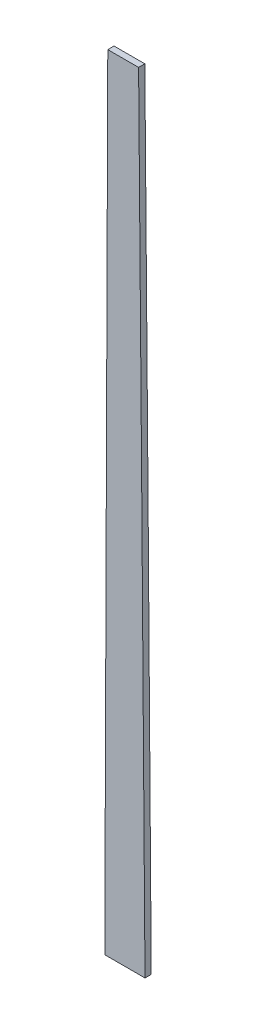
ISO-10303-21;
HEADER;
FILE_DESCRIPTION(('STEP AP214'),'2;1');
FILE_NAME('part.step','',(''),(''),'','','');
FILE_SCHEMA(('AUTOMOTIVE_DESIGN { 1 0 10303 214 1 1 1 1 }'));
ENDSEC;
DATA;
#1=APPLICATION_CONTEXT('core data for automotive mechanical design processes');
#2=APPLICATION_PROTOCOL_DEFINITION('international standard','automotive_design',2000,#1);
#3=PRODUCT_CONTEXT('',#1,'mechanical');
#4=PRODUCT('Part','Part','',(#3));
#5=PRODUCT_RELATED_PRODUCT_CATEGORY('part','',(#4));
#6=PRODUCT_DEFINITION_FORMATION('','',#4);
#7=PRODUCT_DEFINITION_CONTEXT('part definition',#1,'design');
#8=PRODUCT_DEFINITION('design','',#6,#7);
#9=PRODUCT_DEFINITION_SHAPE('','',#8);
#10=(LENGTH_UNIT() NAMED_UNIT(*) SI_UNIT(.MILLI.,.METRE.));
#11=(NAMED_UNIT(*) PLANE_ANGLE_UNIT() SI_UNIT($,.RADIAN.));
#12=(NAMED_UNIT(*) SI_UNIT($,.STERADIAN.) SOLID_ANGLE_UNIT());
#13=UNCERTAINTY_MEASURE_WITH_UNIT(LENGTH_MEASURE(1.E-05),#10,'distance_accuracy_value','');
#14=(GEOMETRIC_REPRESENTATION_CONTEXT(3) GLOBAL_UNCERTAINTY_ASSIGNED_CONTEXT((#13)) GLOBAL_UNIT_ASSIGNED_CONTEXT((#10,
#11,#12)) REPRESENTATION_CONTEXT('',''));
#15=CARTESIAN_POINT('',(0.,0.,0.));
#16=DIRECTION('',(0.,0.,1.));
#17=DIRECTION('',(1.,0.,0.));
#18=AXIS2_PLACEMENT_3D('',#15,#16,#17);
#19=CARTESIAN_POINT('',(13.6213145274313,0.,3.175));
#20=CARTESIAN_POINT('',(12.6374336694443,133.332819396335,3.175));
#21=CARTESIAN_POINT('',(11.56864622104,266.665030355246,3.175));
#22=CARTESIAN_POINT('',(10.3597378287203,399.996,3.175));
#23=B_SPLINE_CURVE_WITH_KNOTS('',3,(#19,#20,#21,#22),.UNSPECIFIED.,.F.,.F.,(4,4),(0.,1.),.UNSPECIFIED.);
#24=DIRECTION('',(0.,0.,-1.));
#25=VECTOR('',#24,1.);
#26=SURFACE_OF_LINEAR_EXTRUSION('',#23,#25);
#27=CARTESIAN_POINT('',(13.6213145274313,0.,0.));
#28=CARTESIAN_POINT('',(12.6374336694443,133.332819396335,0.));
#29=CARTESIAN_POINT('',(11.56864622104,266.665030355246,0.));
#30=CARTESIAN_POINT('',(10.3597378287203,399.996,0.));
#31=B_SPLINE_CURVE_WITH_KNOTS('',3,(#27,#28,#29,#30),.UNSPECIFIED.,.F.,.F.,(4,4),(0.,1.),.UNSPECIFIED.);
#32=CARTESIAN_POINT('',(13.6213145274313,0.,0.));
#33=VERTEX_POINT('',#32);
#34=CARTESIAN_POINT('',(10.3597378287203,399.996,0.));
#35=VERTEX_POINT('',#34);
#36=EDGE_CURVE('E116',#33,#35,#31,.T.);
#37=ORIENTED_EDGE('',*,*,#36,.T.);
#38=DIRECTION('',(0.,0.,-1.));
#39=VECTOR('',#38,1.);
#40=CARTESIAN_POINT('',(10.3597378287203,399.996,3.175));
#41=LINE('',#40,#39);
#42=CARTESIAN_POINT('',(10.3597378287203,399.996,3.175));
#43=VERTEX_POINT('',#42);
#44=EDGE_CURVE('E11',#43,#35,#41,.T.);
#45=ORIENTED_EDGE('',*,*,#44,.F.);
#46=CARTESIAN_POINT('',(13.6213145274313,0.,3.175));
#47=VERTEX_POINT('',#46);
#48=EDGE_CURVE('E85',#47,#43,#23,.T.);
#49=ORIENTED_EDGE('',*,*,#48,.F.);
#50=DIRECTION('',(0.,0.,-1.));
#51=VECTOR('',#50,1.);
#52=CARTESIAN_POINT('',(13.6213145274313,0.,3.175));
#53=LINE('',#52,#51);
#54=EDGE_CURVE('E93',#47,#33,#53,.T.);
#55=ORIENTED_EDGE('',*,*,#54,.T.);
#56=EDGE_LOOP('',(#37,#45,#49,#55));
#57=FACE_BOUND('',#56,.T.);
#58=ADVANCED_FACE('F33',(#57),#26,.F.);
#59=CARTESIAN_POINT('',(-5.33538119678879,399.996,3.175));
#60=DIRECTION('',(0.,-1.,0.));
#61=DIRECTION('',(1.,0.,0.));
#62=AXIS2_PLACEMENT_3D('',#59,#60,#61);
#63=PLANE('',#62);
#64=DIRECTION('',(-1.,0.,0.));
#65=VECTOR('',#64,1.);
#66=CARTESIAN_POINT('',(-5.33538119678879,399.996,0.));
#67=LINE('',#66,#65);
#68=CARTESIAN_POINT('',(-5.33538119678879,399.996,0.));
#69=VERTEX_POINT('',#68);
#70=EDGE_CURVE('E89',#35,#69,#67,.T.);
#71=ORIENTED_EDGE('',*,*,#70,.T.);
#72=DIRECTION('',(0.,0.,-1.));
#73=VECTOR('',#72,1.);
#74=CARTESIAN_POINT('',(-5.33538119678879,399.996,3.175));
#75=LINE('',#74,#73);
#76=CARTESIAN_POINT('',(-5.33538119678879,399.996,3.175));
#77=VERTEX_POINT('',#76);
#78=EDGE_CURVE('E42',#77,#69,#75,.T.);
#79=ORIENTED_EDGE('',*,*,#78,.F.);
#80=DIRECTION('',(-1.,0.,0.));
#81=VECTOR('',#80,1.);
#82=CARTESIAN_POINT('',(-5.33538119678879,399.996,3.175));
#83=LINE('',#82,#81);
#84=EDGE_CURVE('E80',#43,#77,#83,.T.);
#85=ORIENTED_EDGE('',*,*,#84,.F.);
#86=ORIENTED_EDGE('',*,*,#44,.T.);
#87=EDGE_LOOP('',(#71,#79,#85,#86));
#88=FACE_BOUND('',#87,.T.);
#89=ADVANCED_FACE('F88',(#88),#63,.F.);
#90=CARTESIAN_POINT('',(-5.33538119678879,399.996,3.175));
#91=CARTESIAN_POINT('',(-5.6421713569418,333.330206893907,3.175));
#92=CARTESIAN_POINT('',(-5.91555632295596,266.664264512628,3.175));
#93=CARTESIAN_POINT('',(-6.42194285685333,133.332229762521,3.175));
#94=CARTESIAN_POINT('',(-6.65521386443951,66.6661372662359,3.175));
#95=CARTESIAN_POINT('',(-6.87470605578451,0.,3.175));
#96=B_SPLINE_CURVE_WITH_KNOTS('',3,(#90,#91,#92,#93,#94,#95),.UNSPECIFIED.,.F.,.F.,(4,2,4),(0.,
0.5,1.),.UNSPECIFIED.);
#97=DIRECTION('',(0.,0.,-1.));
#98=VECTOR('',#97,1.);
#99=SURFACE_OF_LINEAR_EXTRUSION('',#96,#98);
#100=CARTESIAN_POINT('',(-5.33538119678879,399.996,0.));
#101=CARTESIAN_POINT('',(-5.6421713569418,333.330206893907,0.));
#102=CARTESIAN_POINT('',(-5.91555632295596,266.664264512628,0.));
#103=CARTESIAN_POINT('',(-6.42194285685333,133.332229762521,0.));
#104=CARTESIAN_POINT('',(-6.65521386443951,66.6661372662359,0.));
#105=CARTESIAN_POINT('',(-6.87470605578451,0.,0.));
#106=B_SPLINE_CURVE_WITH_KNOTS('',3,(#100,#101,#102,#103,#104,#105),.UNSPECIFIED.,.F.,.F.,(4,2,
4),(0.,0.5,1.),.UNSPECIFIED.);
#107=CARTESIAN_POINT('',(-6.87470605578451,0.,0.));
#108=VERTEX_POINT('',#107);
#109=EDGE_CURVE('E67',#69,#108,#106,.T.);
#110=ORIENTED_EDGE('',*,*,#109,.T.);
#111=DIRECTION('',(0.,0.,-1.));
#112=VECTOR('',#111,1.);
#113=CARTESIAN_POINT('',(-6.87470605578451,0.,3.175));
#114=LINE('',#113,#112);
#115=CARTESIAN_POINT('',(-6.87470605578451,0.,3.175));
#116=VERTEX_POINT('',#115);
#117=EDGE_CURVE('E90',#116,#108,#114,.T.);
#118=ORIENTED_EDGE('',*,*,#117,.F.);
#119=EDGE_CURVE('E83',#77,#116,#96,.T.);
#120=ORIENTED_EDGE('',*,*,#119,.F.);
#121=ORIENTED_EDGE('',*,*,#78,.T.);
#122=EDGE_LOOP('',(#110,#118,#120,#121));
#123=FACE_BOUND('',#122,.T.);
#124=ADVANCED_FACE('F91',(#123),#99,.F.);
#125=CARTESIAN_POINT('',(-6.87470605578451,0.,3.175));
#126=DIRECTION('',(0.,1.,0.));
#127=DIRECTION('',(-1.,0.,0.));
#128=AXIS2_PLACEMENT_3D('',#125,#126,#127);
#129=PLANE('',#128);
#130=DIRECTION('',(1.,0.,0.));
#131=VECTOR('',#130,1.);
#132=CARTESIAN_POINT('',(-6.87470605578451,0.,0.));
#133=LINE('',#132,#131);
#134=EDGE_CURVE('E73',#108,#33,#133,.T.);
#135=ORIENTED_EDGE('',*,*,#134,.T.);
#136=ORIENTED_EDGE('',*,*,#54,.F.);
#137=DIRECTION('',(1.,0.,0.));
#138=VECTOR('',#137,1.);
#139=CARTESIAN_POINT('',(-6.87470605578451,0.,3.175));
#140=LINE('',#139,#138);
#141=EDGE_CURVE('E50',#116,#47,#140,.T.);
#142=ORIENTED_EDGE('',*,*,#141,.F.);
#143=ORIENTED_EDGE('',*,*,#117,.T.);
#144=EDGE_LOOP('',(#135,#136,#142,#143));
#145=FACE_BOUND('',#144,.T.);
#146=ADVANCED_FACE('F105',(#145),#129,.F.);
#147=CARTESIAN_POINT('',(12.0749115034505,199.998693656843,3.175));
#148=DIRECTION('',(0.,0.,-1.));
#149=DIRECTION('',(-1.,0.,0.));
#150=AXIS2_PLACEMENT_3D('',#147,#148,#149);
#151=PLANE('',#150);
#152=ORIENTED_EDGE('',*,*,#48,.T.);
#153=ORIENTED_EDGE('',*,*,#84,.T.);
#154=ORIENTED_EDGE('',*,*,#119,.T.);
#155=ORIENTED_EDGE('',*,*,#141,.T.);
#156=EDGE_LOOP('',(#152,#153,#154,#155));
#157=FACE_BOUND('',#156,.T.);
#158=ADVANCED_FACE('F81',(#157),#151,.F.);
#159=CARTESIAN_POINT('',(12.0749115034505,199.998693656843,0.));
#160=DIRECTION('',(0.,0.,-1.));
#161=DIRECTION('',(-1.,0.,0.));
#162=AXIS2_PLACEMENT_3D('',#159,#160,#161);
#163=PLANE('',#162);
#164=ORIENTED_EDGE('',*,*,#36,.F.);
#165=ORIENTED_EDGE('',*,*,#134,.F.);
#166=ORIENTED_EDGE('',*,*,#109,.F.);
#167=ORIENTED_EDGE('',*,*,#70,.F.);
#168=EDGE_LOOP('',(#164,#165,#166,#167));
#169=FACE_BOUND('',#168,.T.);
#170=ADVANCED_FACE('F133',(#169),#163,.T.);
#171=CLOSED_SHELL('',(#58,#89,#124,#146,#158,#170));
#172=MANIFOLD_SOLID_BREP('B2',#171);
#173=ADVANCED_BREP_SHAPE_REPRESENTATION('',(#18,#172),#14);
#174=SHAPE_DEFINITION_REPRESENTATION(#9,#173);
ENDSEC;
END-ISO-10303-21;
